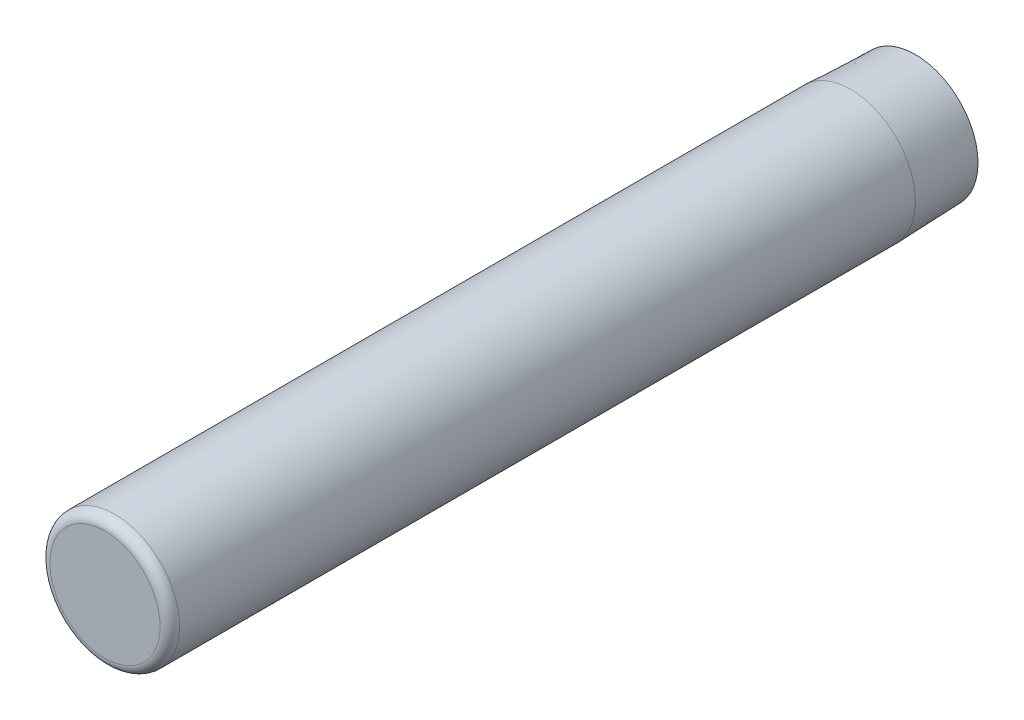
ISO-10303-21;
HEADER;
FILE_DESCRIPTION(('STEP AP214'),'2;1');
FILE_NAME('part.step','',(''),(''),'','','');
FILE_SCHEMA(('AUTOMOTIVE_DESIGN { 1 0 10303 214 1 1 1 1 }'));
ENDSEC;
DATA;
#1=APPLICATION_CONTEXT('core data for automotive mechanical design processes');
#2=APPLICATION_PROTOCOL_DEFINITION('international standard','automotive_design',2000,#1);
#3=PRODUCT_CONTEXT('',#1,'mechanical');
#4=PRODUCT('Part','Part','',(#3));
#5=PRODUCT_RELATED_PRODUCT_CATEGORY('part','',(#4));
#6=PRODUCT_DEFINITION_FORMATION('','',#4);
#7=PRODUCT_DEFINITION_CONTEXT('part definition',#1,'design');
#8=PRODUCT_DEFINITION('design','',#6,#7);
#9=PRODUCT_DEFINITION_SHAPE('','',#8);
#10=(LENGTH_UNIT() NAMED_UNIT(*) SI_UNIT(.MILLI.,.METRE.));
#11=(NAMED_UNIT(*) PLANE_ANGLE_UNIT() SI_UNIT($,.RADIAN.));
#12=(NAMED_UNIT(*) SI_UNIT($,.STERADIAN.) SOLID_ANGLE_UNIT());
#13=UNCERTAINTY_MEASURE_WITH_UNIT(LENGTH_MEASURE(1.E-05),#10,'distance_accuracy_value','');
#14=(GEOMETRIC_REPRESENTATION_CONTEXT(3) GLOBAL_UNCERTAINTY_ASSIGNED_CONTEXT((#13)) GLOBAL_UNIT_ASSIGNED_CONTEXT((#10,
#11,#12)) REPRESENTATION_CONTEXT('',''));
#15=CARTESIAN_POINT('',(0.,0.,0.));
#16=DIRECTION('',(0.,0.,1.));
#17=DIRECTION('',(1.,0.,0.));
#18=AXIS2_PLACEMENT_3D('',#15,#16,#17);
#19=CARTESIAN_POINT('',(0.,0.,25.));
#20=DIRECTION('',(0.,0.,-1.));
#21=DIRECTION('',(-1.,0.,0.));
#22=AXIS2_PLACEMENT_3D('',#19,#20,#21);
#23=CYLINDRICAL_SURFACE('',#22,2.);
#24=CARTESIAN_POINT('',(0.,0.,24.7));
#25=DIRECTION('',(0.,0.,1.));
#26=DIRECTION('',(1.,0.,0.));
#27=AXIS2_PLACEMENT_3D('',#24,#25,#26);
#28=CIRCLE('',#27,2.);
#29=CARTESIAN_POINT('',(2.,0.,24.7));
#30=VERTEX_POINT('',#29);
#31=EDGE_CURVE('E10',#30,#30,#28,.F.);
#32=ORIENTED_EDGE('',*,*,#31,.T.);
#33=EDGE_LOOP('',(#32));
#34=FACE_BOUND('',#33,.T.);
#35=CARTESIAN_POINT('',(0.,0.,2.0000000000001));
#36=DIRECTION('',(0.,0.,1.));
#37=DIRECTION('',(1.,0.,0.));
#38=AXIS2_PLACEMENT_3D('',#35,#36,#37);
#39=CIRCLE('',#38,2.);
#40=CARTESIAN_POINT('',(2.,0.,2.0000000000001));
#41=VERTEX_POINT('',#40);
#42=EDGE_CURVE('E46',#41,#41,#39,.T.);
#43=ORIENTED_EDGE('',*,*,#42,.T.);
#44=EDGE_LOOP('',(#43));
#45=FACE_BOUND('',#44,.T.);
#46=ADVANCED_FACE('F31',(#34,#45),#23,.T.);
#47=CARTESIAN_POINT('',(0.,0.,25.));
#48=DIRECTION('',(0.,0.,1.));
#49=DIRECTION('',(1.,0.,0.));
#50=AXIS2_PLACEMENT_3D('',#47,#48,#49);
#51=PLANE('',#50);
#52=CARTESIAN_POINT('',(0.,0.,25.));
#53=DIRECTION('',(0.,0.,1.));
#54=DIRECTION('',(1.,0.,0.));
#55=AXIS2_PLACEMENT_3D('',#52,#53,#54);
#56=CIRCLE('',#55,1.7);
#57=CARTESIAN_POINT('',(1.7,0.,25.));
#58=VERTEX_POINT('',#57);
#59=EDGE_CURVE('E38',#58,#58,#56,.T.);
#60=ORIENTED_EDGE('',*,*,#59,.T.);
#61=EDGE_LOOP('',(#60));
#62=FACE_BOUND('',#61,.T.);
#63=ADVANCED_FACE('F62',(#62),#51,.T.);
#64=CARTESIAN_POINT('',(0.,0.,0.));
#65=DIRECTION('',(0.,0.,1.));
#66=DIRECTION('',(1.,0.,0.));
#67=AXIS2_PLACEMENT_3D('',#64,#65,#66);
#68=PLANE('',#67);
#69=CARTESIAN_POINT('',(0.,0.,0.));
#70=DIRECTION('',(0.,0.,1.));
#71=DIRECTION('',(1.,0.,0.));
#72=AXIS2_PLACEMENT_3D('',#69,#70,#71);
#73=CIRCLE('',#72,1.93015846101651);
#74=CARTESIAN_POINT('',(1.93015846101651,0.,0.));
#75=VERTEX_POINT('',#74);
#76=EDGE_CURVE('E42',#75,#75,#73,.F.);
#77=ORIENTED_EDGE('',*,*,#76,.T.);
#78=EDGE_LOOP('',(#77));
#79=FACE_BOUND('',#78,.T.);
#80=ADVANCED_FACE('F55',(#79),#68,.F.);
#81=CARTESIAN_POINT('',(0.,0.,2.0000000000001));
#82=DIRECTION('',(0.,0.,1.));
#83=DIRECTION('',(1.,0.,0.));
#84=AXIS2_PLACEMENT_3D('',#81,#82,#83);
#85=CONICAL_SURFACE('',#84,2.,0.0349065850398834);
#86=ORIENTED_EDGE('',*,*,#76,.F.);
#87=EDGE_LOOP('',(#86));
#88=FACE_BOUND('',#87,.T.);
#89=ORIENTED_EDGE('',*,*,#42,.F.);
#90=EDGE_LOOP('',(#89));
#91=FACE_BOUND('',#90,.T.);
#92=ADVANCED_FACE('F53',(#88,#91),#85,.T.);
#93=CARTESIAN_POINT('',(0.,0.,24.7));
#94=DIRECTION('',(0.,0.,1.));
#95=DIRECTION('',(1.,0.,0.));
#96=AXIS2_PLACEMENT_3D('',#93,#94,#95);
#97=TOROIDAL_SURFACE('',#96,1.7,0.3);
#98=ORIENTED_EDGE('',*,*,#31,.F.);
#99=EDGE_LOOP('',(#98));
#100=FACE_BOUND('',#99,.T.);
#101=ORIENTED_EDGE('',*,*,#59,.F.);
#102=EDGE_LOOP('',(#101));
#103=FACE_BOUND('',#102,.T.);
#104=ADVANCED_FACE('F33',(#100,#103),#97,.T.);
#105=CLOSED_SHELL('',(#46,#63,#80,#92,#104));
#106=MANIFOLD_SOLID_BREP('B2',#105);
#107=ADVANCED_BREP_SHAPE_REPRESENTATION('',(#18,#106),#14);
#108=SHAPE_DEFINITION_REPRESENTATION(#9,#107);
ENDSEC;
END-ISO-10303-21;
